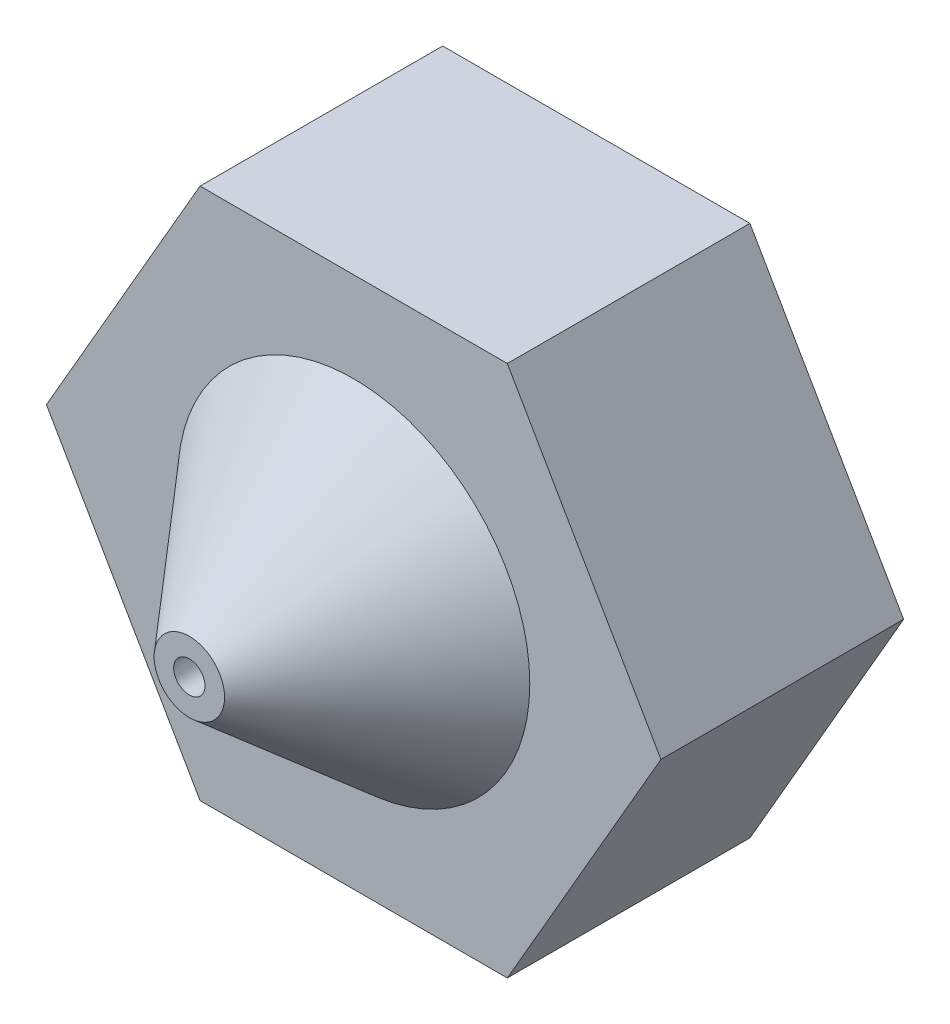
ISO-10303-21;
HEADER;
FILE_DESCRIPTION(('STEP AP214'),'2;1');
FILE_NAME('part.step','',(''),(''),'','','');
FILE_SCHEMA(('AUTOMOTIVE_DESIGN { 1 0 10303 214 1 1 1 1 }'));
ENDSEC;
DATA;
#1=APPLICATION_CONTEXT('core data for automotive mechanical design processes');
#2=APPLICATION_PROTOCOL_DEFINITION('international standard','automotive_design',2000,#1);
#3=PRODUCT_CONTEXT('',#1,'mechanical');
#4=PRODUCT('Part','Part','',(#3));
#5=PRODUCT_RELATED_PRODUCT_CATEGORY('part','',(#4));
#6=PRODUCT_DEFINITION_FORMATION('','',#4);
#7=PRODUCT_DEFINITION_CONTEXT('part definition',#1,'design');
#8=PRODUCT_DEFINITION('design','',#6,#7);
#9=PRODUCT_DEFINITION_SHAPE('','',#8);
#10=(LENGTH_UNIT() NAMED_UNIT(*) SI_UNIT(.MILLI.,.METRE.));
#11=(NAMED_UNIT(*) PLANE_ANGLE_UNIT() SI_UNIT($,.RADIAN.));
#12=(NAMED_UNIT(*) SI_UNIT($,.STERADIAN.) SOLID_ANGLE_UNIT());
#13=UNCERTAINTY_MEASURE_WITH_UNIT(LENGTH_MEASURE(1.E-05),#10,'distance_accuracy_value','');
#14=(GEOMETRIC_REPRESENTATION_CONTEXT(3) GLOBAL_UNCERTAINTY_ASSIGNED_CONTEXT((#13)) GLOBAL_UNIT_ASSIGNED_CONTEXT((#10,
#11,#12)) REPRESENTATION_CONTEXT('',''));
#15=CARTESIAN_POINT('',(0.,0.,0.));
#16=DIRECTION('',(0.,0.,1.));
#17=DIRECTION('',(1.,0.,0.));
#18=AXIS2_PLACEMENT_3D('',#15,#16,#17);
#19=CARTESIAN_POINT('',(0.,0.,3.1));
#20=DIRECTION('',(0.,0.,1.));
#21=DIRECTION('',(1.,0.,0.));
#22=AXIS2_PLACEMENT_3D('',#19,#20,#21);
#23=PLANE('',#22);
#24=DIRECTION('',(1.,0.,0.));
#25=VECTOR('',#24,1.);
#26=CARTESIAN_POINT('',(-7.56299091524473,1.6,3.1));
#27=LINE('',#26,#25);
#28=CARTESIAN_POINT('',(-7.56299091524473,1.6,3.1));
#29=VERTEX_POINT('',#28);
#30=CARTESIAN_POINT('',(-3.63700908475527,1.6,3.1));
#31=VERTEX_POINT('',#30);
#32=EDGE_CURVE('E132',#29,#31,#27,.T.);
#33=ORIENTED_EDGE('',*,*,#32,.T.);
#34=DIRECTION('',(0.5,0.866025403784439,0.));
#35=VECTOR('',#34,1.);
#36=CARTESIAN_POINT('',(-3.63700908475527,1.6,3.1));
#37=LINE('',#36,#35);
#38=CARTESIAN_POINT('',(-1.67401816951054,5.,3.1));
#39=VERTEX_POINT('',#38);
#40=EDGE_CURVE('E90',#31,#39,#37,.T.);
#41=ORIENTED_EDGE('',*,*,#40,.T.);
#42=DIRECTION('',(-0.5,0.866025403784439,0.));
#43=VECTOR('',#42,1.);
#44=CARTESIAN_POINT('',(-1.67401816951054,5.,3.1));
#45=LINE('',#44,#43);
#46=CARTESIAN_POINT('',(-3.63700908475527,8.4,3.1));
#47=VERTEX_POINT('',#46);
#48=EDGE_CURVE('E103',#39,#47,#45,.T.);
#49=ORIENTED_EDGE('',*,*,#48,.T.);
#50=DIRECTION('',(-1.,0.,0.));
#51=VECTOR('',#50,1.);
#52=CARTESIAN_POINT('',(-3.63700908475527,8.4,3.1));
#53=LINE('',#52,#51);
#54=CARTESIAN_POINT('',(-7.56299091524473,8.4,3.1));
#55=VERTEX_POINT('',#54);
#56=EDGE_CURVE('E97',#47,#55,#53,.T.);
#57=ORIENTED_EDGE('',*,*,#56,.T.);
#58=DIRECTION('',(-0.5,-0.866025403784438,0.));
#59=VECTOR('',#58,1.);
#60=CARTESIAN_POINT('',(-7.56299091524473,8.4,3.1));
#61=LINE('',#60,#59);
#62=CARTESIAN_POINT('',(-9.52598183048945,5.,3.1));
#63=VERTEX_POINT('',#62);
#64=EDGE_CURVE('E101',#55,#63,#61,.T.);
#65=ORIENTED_EDGE('',*,*,#64,.T.);
#66=DIRECTION('',(0.5,-0.866025403784439,0.));
#67=VECTOR('',#66,1.);
#68=CARTESIAN_POINT('',(-9.52598183048945,5.,3.1));
#69=LINE('',#68,#67);
#70=EDGE_CURVE('E53',#63,#29,#69,.T.);
#71=ORIENTED_EDGE('',*,*,#70,.T.);
#72=EDGE_LOOP('',(#33,#41,#49,#57,#65,#71));
#73=FACE_BOUND('',#72,.T.);
#74=CARTESIAN_POINT('',(-5.6,5.,3.1));
#75=DIRECTION('',(0.,0.,1.));
#76=DIRECTION('',(1.,0.,0.));
#77=AXIS2_PLACEMENT_3D('',#74,#75,#76);
#78=CIRCLE('',#77,2.25);
#79=CARTESIAN_POINT('',(-3.35,5.,3.1));
#80=VERTEX_POINT('',#79);
#81=EDGE_CURVE('E183',#80,#80,#78,.T.);
#82=ORIENTED_EDGE('',*,*,#81,.F.);
#83=EDGE_LOOP('',(#82));
#84=FACE_BOUND('',#83,.T.);
#85=ADVANCED_FACE('F36',(#73,#84),#23,.T.);
#86=CARTESIAN_POINT('',(-7.56299091524473,1.6,3.1));
#87=DIRECTION('',(0.,1.,0.));
#88=DIRECTION('',(-1.,0.,0.));
#89=AXIS2_PLACEMENT_3D('',#86,#87,#88);
#90=PLANE('',#89);
#91=DIRECTION('',(1.,0.,0.));
#92=VECTOR('',#91,1.);
#93=CARTESIAN_POINT('',(-7.56299091524473,1.6,0.));
#94=LINE('',#93,#92);
#95=CARTESIAN_POINT('',(-7.56299091524473,1.6,0.));
#96=VERTEX_POINT('',#95);
#97=CARTESIAN_POINT('',(-3.63700908475527,1.6,0.));
#98=VERTEX_POINT('',#97);
#99=EDGE_CURVE('E121',#96,#98,#94,.T.);
#100=ORIENTED_EDGE('',*,*,#99,.T.);
#101=DIRECTION('',(0.,0.,-1.));
#102=VECTOR('',#101,1.);
#103=CARTESIAN_POINT('',(-3.63700908475527,1.6,3.1));
#104=LINE('',#103,#102);
#105=EDGE_CURVE('E12',#31,#98,#104,.T.);
#106=ORIENTED_EDGE('',*,*,#105,.F.);
#107=ORIENTED_EDGE('',*,*,#32,.F.);
#108=DIRECTION('',(0.,0.,-1.));
#109=VECTOR('',#108,1.);
#110=CARTESIAN_POINT('',(-7.56299091524473,1.6,3.1));
#111=LINE('',#110,#109);
#112=EDGE_CURVE('E117',#29,#96,#111,.T.);
#113=ORIENTED_EDGE('',*,*,#112,.T.);
#114=EDGE_LOOP('',(#100,#106,#107,#113));
#115=FACE_BOUND('',#114,.T.);
#116=ADVANCED_FACE('F38',(#115),#90,.F.);
#117=CARTESIAN_POINT('',(-3.63700908475527,1.6,3.1));
#118=DIRECTION('',(-0.866025403784439,0.5,0.));
#119=DIRECTION('',(-0.5,-0.866025403784439,0.));
#120=AXIS2_PLACEMENT_3D('',#117,#118,#119);
#121=PLANE('',#120);
#122=DIRECTION('',(0.5,0.866025403784439,0.));
#123=VECTOR('',#122,1.);
#124=CARTESIAN_POINT('',(-3.63700908475527,1.6,0.));
#125=LINE('',#124,#123);
#126=CARTESIAN_POINT('',(-1.67401816951054,5.,0.));
#127=VERTEX_POINT('',#126);
#128=EDGE_CURVE('E124',#98,#127,#125,.T.);
#129=ORIENTED_EDGE('',*,*,#128,.T.);
#130=DIRECTION('',(0.,0.,-1.));
#131=VECTOR('',#130,1.);
#132=CARTESIAN_POINT('',(-1.67401816951054,5.,3.1));
#133=LINE('',#132,#131);
#134=EDGE_CURVE('E45',#39,#127,#133,.T.);
#135=ORIENTED_EDGE('',*,*,#134,.F.);
#136=ORIENTED_EDGE('',*,*,#40,.F.);
#137=ORIENTED_EDGE('',*,*,#105,.T.);
#138=EDGE_LOOP('',(#129,#135,#136,#137));
#139=FACE_BOUND('',#138,.T.);
#140=ADVANCED_FACE('F161',(#139),#121,.F.);
#141=CARTESIAN_POINT('',(-1.67401816951054,5.,3.1));
#142=DIRECTION('',(-0.866025403784439,-0.5,0.));
#143=DIRECTION('',(0.5,-0.866025403784439,0.));
#144=AXIS2_PLACEMENT_3D('',#141,#142,#143);
#145=PLANE('',#144);
#146=DIRECTION('',(-0.5,0.866025403784439,0.));
#147=VECTOR('',#146,1.);
#148=CARTESIAN_POINT('',(-1.67401816951054,5.,0.));
#149=LINE('',#148,#147);
#150=CARTESIAN_POINT('',(-3.63700908475527,8.4,0.));
#151=VERTEX_POINT('',#150);
#152=EDGE_CURVE('E127',#127,#151,#149,.T.);
#153=ORIENTED_EDGE('',*,*,#152,.T.);
#154=DIRECTION('',(0.,0.,-1.));
#155=VECTOR('',#154,1.);
#156=CARTESIAN_POINT('',(-3.63700908475527,8.4,3.1));
#157=LINE('',#156,#155);
#158=EDGE_CURVE('E112',#47,#151,#157,.T.);
#159=ORIENTED_EDGE('',*,*,#158,.F.);
#160=ORIENTED_EDGE('',*,*,#48,.F.);
#161=ORIENTED_EDGE('',*,*,#134,.T.);
#162=EDGE_LOOP('',(#153,#159,#160,#161));
#163=FACE_BOUND('',#162,.T.);
#164=ADVANCED_FACE('F138',(#163),#145,.F.);
#165=CARTESIAN_POINT('',(-3.63700908475527,8.4,3.1));
#166=DIRECTION('',(0.,-1.,0.));
#167=DIRECTION('',(0.,0.,-1.));
#168=AXIS2_PLACEMENT_3D('',#165,#166,#167);
#169=PLANE('',#168);
#170=DIRECTION('',(-1.,0.,0.));
#171=VECTOR('',#170,1.);
#172=CARTESIAN_POINT('',(-3.63700908475527,8.4,0.));
#173=LINE('',#172,#171);
#174=CARTESIAN_POINT('',(-7.56299091524473,8.4,0.));
#175=VERTEX_POINT('',#174);
#176=EDGE_CURVE('E111',#151,#175,#173,.T.);
#177=ORIENTED_EDGE('',*,*,#176,.T.);
#178=DIRECTION('',(0.,0.,-1.));
#179=VECTOR('',#178,1.);
#180=CARTESIAN_POINT('',(-7.56299091524473,8.4,3.1));
#181=LINE('',#180,#179);
#182=EDGE_CURVE('E108',#55,#175,#181,.T.);
#183=ORIENTED_EDGE('',*,*,#182,.F.);
#184=ORIENTED_EDGE('',*,*,#56,.F.);
#185=ORIENTED_EDGE('',*,*,#158,.T.);
#186=EDGE_LOOP('',(#177,#183,#184,#185));
#187=FACE_BOUND('',#186,.T.);
#188=ADVANCED_FACE('F109',(#187),#169,.F.);
#189=CARTESIAN_POINT('',(-7.56299091524473,8.4,3.1));
#190=DIRECTION('',(0.866025403784439,-0.5,0.));
#191=DIRECTION('',(0.5,0.866025403784439,0.));
#192=AXIS2_PLACEMENT_3D('',#189,#190,#191);
#193=PLANE('',#192);
#194=DIRECTION('',(-0.5,-0.866025403784438,0.));
#195=VECTOR('',#194,1.);
#196=CARTESIAN_POINT('',(-7.56299091524473,8.4,0.));
#197=LINE('',#196,#195);
#198=CARTESIAN_POINT('',(-9.52598183048945,5.,0.));
#199=VERTEX_POINT('',#198);
#200=EDGE_CURVE('E76',#175,#199,#197,.T.);
#201=ORIENTED_EDGE('',*,*,#200,.T.);
#202=DIRECTION('',(0.,0.,-1.));
#203=VECTOR('',#202,1.);
#204=CARTESIAN_POINT('',(-9.52598183048945,5.,3.1));
#205=LINE('',#204,#203);
#206=EDGE_CURVE('E113',#63,#199,#205,.T.);
#207=ORIENTED_EDGE('',*,*,#206,.F.);
#208=ORIENTED_EDGE('',*,*,#64,.F.);
#209=ORIENTED_EDGE('',*,*,#182,.T.);
#210=EDGE_LOOP('',(#201,#207,#208,#209));
#211=FACE_BOUND('',#210,.T.);
#212=ADVANCED_FACE('F115',(#211),#193,.F.);
#213=CARTESIAN_POINT('',(-9.52598183048945,5.,3.1));
#214=DIRECTION('',(0.866025403784439,0.5,0.));
#215=DIRECTION('',(-0.5,0.866025403784439,0.));
#216=AXIS2_PLACEMENT_3D('',#213,#214,#215);
#217=PLANE('',#216);
#218=DIRECTION('',(0.5,-0.866025403784439,0.));
#219=VECTOR('',#218,1.);
#220=CARTESIAN_POINT('',(-9.52598183048945,5.,0.));
#221=LINE('',#220,#219);
#222=EDGE_CURVE('E82',#199,#96,#221,.T.);
#223=ORIENTED_EDGE('',*,*,#222,.T.);
#224=ORIENTED_EDGE('',*,*,#112,.F.);
#225=ORIENTED_EDGE('',*,*,#70,.F.);
#226=ORIENTED_EDGE('',*,*,#206,.T.);
#227=EDGE_LOOP('',(#223,#224,#225,#226));
#228=FACE_BOUND('',#227,.T.);
#229=ADVANCED_FACE('F145',(#228),#217,.F.);
#230=CARTESIAN_POINT('',(0.,0.,0.));
#231=DIRECTION('',(0.,0.,1.));
#232=DIRECTION('',(1.,0.,0.));
#233=AXIS2_PLACEMENT_3D('',#230,#231,#232);
#234=PLANE('',#233);
#235=CARTESIAN_POINT('',(-5.6,5.,0.));
#236=DIRECTION('',(0.,0.,1.));
#237=DIRECTION('',(1.,0.,0.));
#238=AXIS2_PLACEMENT_3D('',#235,#236,#237);
#239=CIRCLE('',#238,0.2);
#240=CARTESIAN_POINT('',(-5.4,5.,0.));
#241=VERTEX_POINT('',#240);
#242=EDGE_CURVE('E190',#241,#241,#239,.T.);
#243=ORIENTED_EDGE('',*,*,#242,.T.);
#244=EDGE_LOOP('',(#243));
#245=FACE_BOUND('',#244,.T.);
#246=ORIENTED_EDGE('',*,*,#99,.F.);
#247=ORIENTED_EDGE('',*,*,#222,.F.);
#248=ORIENTED_EDGE('',*,*,#200,.F.);
#249=ORIENTED_EDGE('',*,*,#176,.F.);
#250=ORIENTED_EDGE('',*,*,#152,.F.);
#251=ORIENTED_EDGE('',*,*,#128,.F.);
#252=EDGE_LOOP('',(#246,#247,#248,#249,#250,#251));
#253=FACE_BOUND('',#252,.T.);
#254=ADVANCED_FACE('F141',(#245,#253),#234,.F.);
#255=CARTESIAN_POINT('',(-5.6,5.,5.2));
#256=DIRECTION('',(0.,0.,1.));
#257=DIRECTION('',(1.,0.,0.));
#258=AXIS2_PLACEMENT_3D('',#255,#256,#257);
#259=PLANE('',#258);
#260=CARTESIAN_POINT('',(-5.6,5.,5.2));
#261=DIRECTION('',(0.,0.,1.));
#262=DIRECTION('',(1.,0.,0.));
#263=AXIS2_PLACEMENT_3D('',#260,#261,#262);
#264=CIRCLE('',#263,0.2);
#265=CARTESIAN_POINT('',(-5.4,5.,5.2));
#266=VERTEX_POINT('',#265);
#267=EDGE_CURVE('E194',#266,#266,#264,.T.);
#268=ORIENTED_EDGE('',*,*,#267,.F.);
#269=EDGE_LOOP('',(#268));
#270=FACE_BOUND('',#269,.T.);
#271=CARTESIAN_POINT('',(-5.6,5.,5.2));
#272=DIRECTION('',(0.,0.,1.));
#273=DIRECTION('',(1.,0.,0.));
#274=AXIS2_PLACEMENT_3D('',#271,#272,#273);
#275=CIRCLE('',#274,0.45);
#276=CARTESIAN_POINT('',(-5.15,5.,5.2));
#277=VERTEX_POINT('',#276);
#278=EDGE_CURVE('E125',#277,#277,#275,.T.);
#279=ORIENTED_EDGE('',*,*,#278,.T.);
#280=EDGE_LOOP('',(#279));
#281=FACE_BOUND('',#280,.T.);
#282=ADVANCED_FACE('F152',(#270,#281),#259,.T.);
#283=CARTESIAN_POINT('',(-5.6,5.,5.2));
#284=DIRECTION('',(0.,0.,-1.));
#285=DIRECTION('',(-1.,0.,0.));
#286=AXIS2_PLACEMENT_3D('',#283,#284,#285);
#287=CONICAL_SURFACE('',#286,0.45,0.70862627212767);
#288=ORIENTED_EDGE('',*,*,#81,.T.);
#289=EDGE_LOOP('',(#288));
#290=FACE_BOUND('',#289,.T.);
#291=ORIENTED_EDGE('',*,*,#278,.F.);
#292=EDGE_LOOP('',(#291));
#293=FACE_BOUND('',#292,.T.);
#294=ADVANCED_FACE('F166',(#290,#293),#287,.T.);
#295=CARTESIAN_POINT('',(-5.6,5.,0.));
#296=DIRECTION('',(0.,0.,1.));
#297=DIRECTION('',(1.,0.,0.));
#298=AXIS2_PLACEMENT_3D('',#295,#296,#297);
#299=CYLINDRICAL_SURFACE('',#298,0.2);
#300=ORIENTED_EDGE('',*,*,#242,.F.);
#301=EDGE_LOOP('',(#300));
#302=FACE_BOUND('',#301,.T.);
#303=ORIENTED_EDGE('',*,*,#267,.T.);
#304=EDGE_LOOP('',(#303));
#305=FACE_BOUND('',#304,.T.);
#306=ADVANCED_FACE('F210',(#302,#305),#299,.F.);
#307=CLOSED_SHELL('',(#85,#116,#140,#164,#188,#212,#229,#254,#282,#294,#306));
#308=MANIFOLD_SOLID_BREP('B2',#307);
#309=ADVANCED_BREP_SHAPE_REPRESENTATION('',(#18,#308),#14);
#310=SHAPE_DEFINITION_REPRESENTATION(#9,#309);
ENDSEC;
END-ISO-10303-21;
